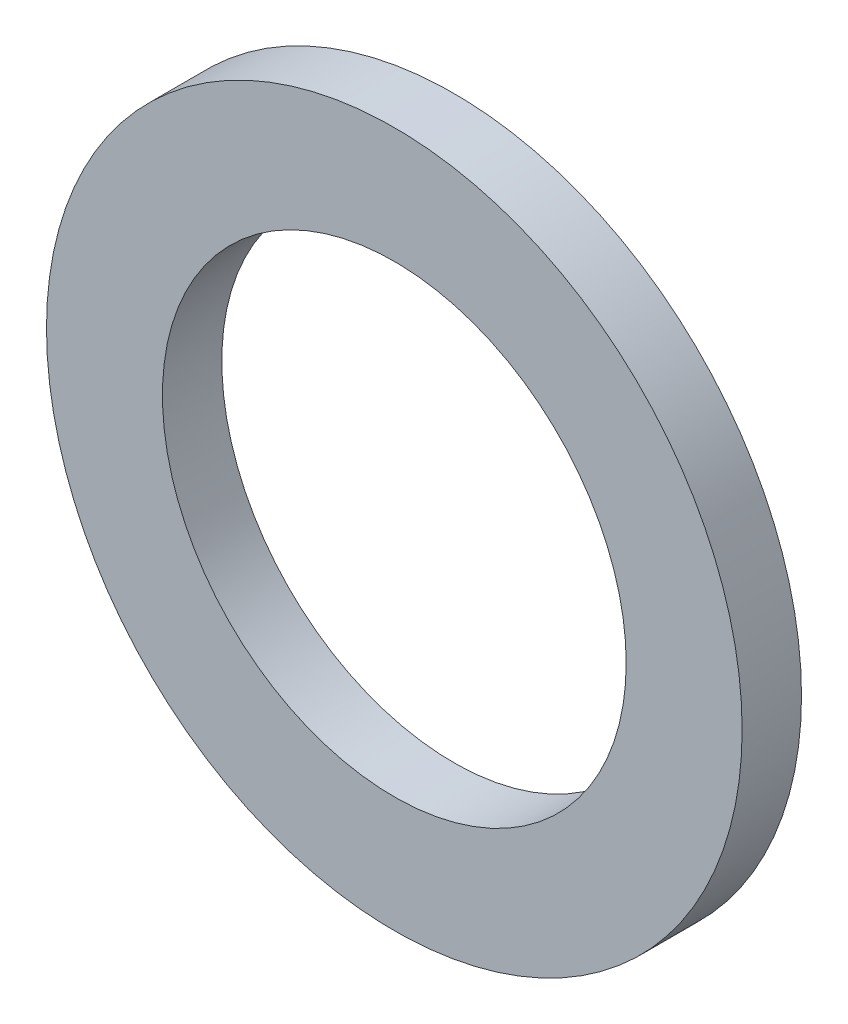
ISO-10303-21;
HEADER;
FILE_DESCRIPTION(('STEP AP214'),'2;1');
FILE_NAME('part.step','',(''),(''),'','','');
FILE_SCHEMA(('AUTOMOTIVE_DESIGN { 1 0 10303 214 1 1 1 1 }'));
ENDSEC;
DATA;
#1=APPLICATION_CONTEXT('core data for automotive mechanical design processes');
#2=APPLICATION_PROTOCOL_DEFINITION('international standard','automotive_design',2000,#1);
#3=PRODUCT_CONTEXT('',#1,'mechanical');
#4=PRODUCT('Part','Part','',(#3));
#5=PRODUCT_RELATED_PRODUCT_CATEGORY('part','',(#4));
#6=PRODUCT_DEFINITION_FORMATION('','',#4);
#7=PRODUCT_DEFINITION_CONTEXT('part definition',#1,'design');
#8=PRODUCT_DEFINITION('design','',#6,#7);
#9=PRODUCT_DEFINITION_SHAPE('','',#8);
#10=(LENGTH_UNIT() NAMED_UNIT(*) SI_UNIT(.MILLI.,.METRE.));
#11=(NAMED_UNIT(*) PLANE_ANGLE_UNIT() SI_UNIT($,.RADIAN.));
#12=(NAMED_UNIT(*) SI_UNIT($,.STERADIAN.) SOLID_ANGLE_UNIT());
#13=UNCERTAINTY_MEASURE_WITH_UNIT(LENGTH_MEASURE(1.E-05),#10,'distance_accuracy_value','');
#14=(GEOMETRIC_REPRESENTATION_CONTEXT(3) GLOBAL_UNCERTAINTY_ASSIGNED_CONTEXT((#13)) GLOBAL_UNIT_ASSIGNED_CONTEXT((#10,
#11,#12)) REPRESENTATION_CONTEXT('',''));
#15=CARTESIAN_POINT('',(0.,0.,0.));
#16=DIRECTION('',(0.,0.,1.));
#17=DIRECTION('',(1.,0.,0.));
#18=AXIS2_PLACEMENT_3D('',#15,#16,#17);
#19=CARTESIAN_POINT('',(0.,0.,-0.8128));
#20=DIRECTION('',(0.,0.,-1.));
#21=DIRECTION('',(1.,0.,0.));
#22=AXIS2_PLACEMENT_3D('',#19,#20,#21);
#23=PLANE('',#22);
#24=CARTESIAN_POINT('',(0.,0.,-0.8128));
#25=DIRECTION('',(0.,0.,1.));
#26=DIRECTION('',(1.,0.,0.));
#27=AXIS2_PLACEMENT_3D('',#24,#25,#26);
#28=CIRCLE('',#27,4.7625);
#29=CARTESIAN_POINT('',(4.7625,0.,-0.8128));
#30=VERTEX_POINT('',#29);
#31=EDGE_CURVE('E10',#30,#30,#28,.T.);
#32=ORIENTED_EDGE('',*,*,#31,.F.);
#33=EDGE_LOOP('',(#32));
#34=FACE_BOUND('',#33,.T.);
#35=CARTESIAN_POINT('',(0.,0.,-0.8128));
#36=DIRECTION('',(0.,0.,1.));
#37=DIRECTION('',(1.,0.,0.));
#38=AXIS2_PLACEMENT_3D('',#35,#36,#37);
#39=CIRCLE('',#38,3.175);
#40=CARTESIAN_POINT('',(3.175,0.,-0.8128));
#41=VERTEX_POINT('',#40);
#42=EDGE_CURVE('E41',#41,#41,#39,.T.);
#43=ORIENTED_EDGE('',*,*,#42,.T.);
#44=EDGE_LOOP('',(#43));
#45=FACE_BOUND('',#44,.T.);
#46=ADVANCED_FACE('F30',(#34,#45),#23,.T.);
#47=CARTESIAN_POINT('',(0.,0.,0.));
#48=DIRECTION('',(0.,0.,-1.));
#49=DIRECTION('',(1.,0.,0.));
#50=AXIS2_PLACEMENT_3D('',#47,#48,#49);
#51=PLANE('',#50);
#52=CARTESIAN_POINT('',(0.,0.,0.));
#53=DIRECTION('',(0.,0.,1.));
#54=DIRECTION('',(1.,0.,0.));
#55=AXIS2_PLACEMENT_3D('',#52,#53,#54);
#56=CIRCLE('',#55,4.7625);
#57=CARTESIAN_POINT('',(4.7625,0.,0.));
#58=VERTEX_POINT('',#57);
#59=EDGE_CURVE('E34',#58,#58,#56,.T.);
#60=ORIENTED_EDGE('',*,*,#59,.T.);
#61=EDGE_LOOP('',(#60));
#62=FACE_BOUND('',#61,.T.);
#63=CARTESIAN_POINT('',(0.,0.,0.));
#64=DIRECTION('',(0.,0.,1.));
#65=DIRECTION('',(1.,0.,0.));
#66=AXIS2_PLACEMENT_3D('',#63,#64,#65);
#67=CIRCLE('',#66,3.175);
#68=CARTESIAN_POINT('',(3.175,0.,0.));
#69=VERTEX_POINT('',#68);
#70=EDGE_CURVE('E43',#69,#69,#67,.T.);
#71=ORIENTED_EDGE('',*,*,#70,.F.);
#72=EDGE_LOOP('',(#71));
#73=FACE_BOUND('',#72,.T.);
#74=ADVANCED_FACE('F56',(#62,#73),#51,.F.);
#75=CARTESIAN_POINT('',(0.,0.,-0.8128));
#76=DIRECTION('',(0.,0.,1.));
#77=DIRECTION('',(-1.,0.,0.));
#78=AXIS2_PLACEMENT_3D('',#75,#76,#77);
#79=CYLINDRICAL_SURFACE('',#78,4.7625);
#80=ORIENTED_EDGE('',*,*,#31,.T.);
#81=EDGE_LOOP('',(#80));
#82=FACE_BOUND('',#81,.T.);
#83=ORIENTED_EDGE('',*,*,#59,.F.);
#84=EDGE_LOOP('',(#83));
#85=FACE_BOUND('',#84,.T.);
#86=ADVANCED_FACE('F32',(#82,#85),#79,.T.);
#87=CARTESIAN_POINT('',(0.,0.,-0.8128));
#88=DIRECTION('',(0.,0.,1.));
#89=DIRECTION('',(-1.,0.,0.));
#90=AXIS2_PLACEMENT_3D('',#87,#88,#89);
#91=CYLINDRICAL_SURFACE('',#90,3.175);
#92=ORIENTED_EDGE('',*,*,#42,.F.);
#93=EDGE_LOOP('',(#92));
#94=FACE_BOUND('',#93,.T.);
#95=ORIENTED_EDGE('',*,*,#70,.T.);
#96=EDGE_LOOP('',(#95));
#97=FACE_BOUND('',#96,.T.);
#98=ADVANCED_FACE('F50',(#94,#97),#91,.F.);
#99=CLOSED_SHELL('',(#46,#74,#86,#98));
#100=MANIFOLD_SOLID_BREP('B2',#99);
#101=ADVANCED_BREP_SHAPE_REPRESENTATION('',(#18,#100),#14);
#102=SHAPE_DEFINITION_REPRESENTATION(#9,#101);
ENDSEC;
END-ISO-10303-21;
